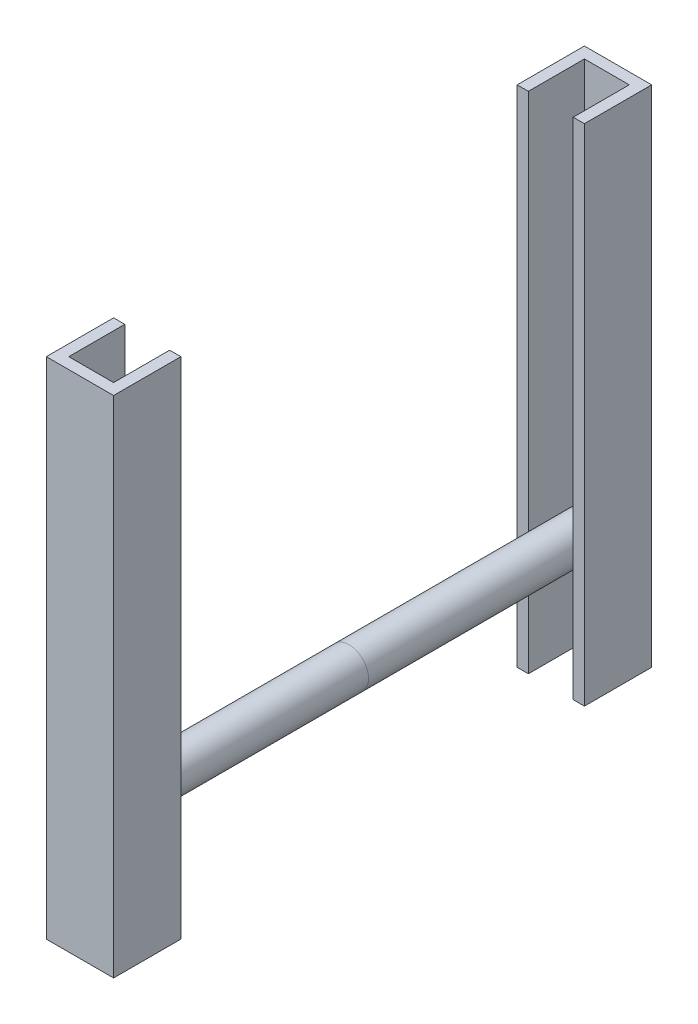
ISO-10303-21;
HEADER;
FILE_DESCRIPTION(('STEP AP214'),'2;1');
FILE_NAME('part.step','',(''),(''),'','','');
FILE_SCHEMA(('AUTOMOTIVE_DESIGN { 1 0 10303 214 1 1 1 1 }'));
ENDSEC;
DATA;
#1=APPLICATION_CONTEXT('core data for automotive mechanical design processes');
#2=APPLICATION_PROTOCOL_DEFINITION('international standard','automotive_design',2000,#1);
#3=PRODUCT_CONTEXT('',#1,'mechanical');
#4=PRODUCT('Part','Part','',(#3));
#5=PRODUCT_RELATED_PRODUCT_CATEGORY('part','',(#4));
#6=PRODUCT_DEFINITION_FORMATION('','',#4);
#7=PRODUCT_DEFINITION_CONTEXT('part definition',#1,'design');
#8=PRODUCT_DEFINITION('design','',#6,#7);
#9=PRODUCT_DEFINITION_SHAPE('','',#8);
#10=(LENGTH_UNIT() NAMED_UNIT(*) SI_UNIT(.MILLI.,.METRE.));
#11=(NAMED_UNIT(*) PLANE_ANGLE_UNIT() SI_UNIT($,.RADIAN.));
#12=(NAMED_UNIT(*) SI_UNIT($,.STERADIAN.) SOLID_ANGLE_UNIT());
#13=UNCERTAINTY_MEASURE_WITH_UNIT(LENGTH_MEASURE(1.E-05),#10,'distance_accuracy_value','');
#14=(GEOMETRIC_REPRESENTATION_CONTEXT(3) GLOBAL_UNCERTAINTY_ASSIGNED_CONTEXT((#13)) GLOBAL_UNIT_ASSIGNED_CONTEXT((#10,
#11,#12)) REPRESENTATION_CONTEXT('',''));
#15=CARTESIAN_POINT('',(0.,0.,0.));
#16=DIRECTION('',(0.,0.,1.));
#17=DIRECTION('',(1.,0.,0.));
#18=AXIS2_PLACEMENT_3D('',#15,#16,#17);
#19=CARTESIAN_POINT('',(20.,225.,-390.));
#20=DIRECTION('',(0.,0.,-1.));
#21=DIRECTION('',(1.,0.,0.));
#22=AXIS2_PLACEMENT_3D('',#19,#20,#21);
#23=PLANE('',#22);
#24=DIRECTION('',(-1.,0.,0.));
#25=VECTOR('',#24,1.);
#26=CARTESIAN_POINT('',(20.,-225.,-390.));
#27=LINE('',#26,#25);
#28=CARTESIAN_POINT('',(30.,-225.,-390.));
#29=VERTEX_POINT('',#28);
#30=CARTESIAN_POINT('',(20.,-225.,-390.));
#31=VERTEX_POINT('',#30);
#32=EDGE_CURVE('E150',#29,#31,#27,.T.);
#33=ORIENTED_EDGE('',*,*,#32,.F.);
#34=DIRECTION('',(0.,-1.,0.));
#35=VECTOR('',#34,1.);
#36=CARTESIAN_POINT('',(30.,225.,-390.));
#37=LINE('',#36,#35);
#38=CARTESIAN_POINT('',(30.,225.,-390.));
#39=VERTEX_POINT('',#38);
#40=EDGE_CURVE('E149',#39,#29,#37,.T.);
#41=ORIENTED_EDGE('',*,*,#40,.F.);
#42=DIRECTION('',(-1.,0.,0.));
#43=VECTOR('',#42,1.);
#44=CARTESIAN_POINT('',(20.,225.,-390.));
#45=LINE('',#44,#43);
#46=CARTESIAN_POINT('',(20.,225.,-390.));
#47=VERTEX_POINT('',#46);
#48=EDGE_CURVE('E176',#39,#47,#45,.T.);
#49=ORIENTED_EDGE('',*,*,#48,.T.);
#50=DIRECTION('',(0.,-1.,0.));
#51=VECTOR('',#50,1.);
#52=CARTESIAN_POINT('',(20.,225.,-390.));
#53=LINE('',#52,#51);
#54=EDGE_CURVE('E12',#47,#31,#53,.T.);
#55=ORIENTED_EDGE('',*,*,#54,.T.);
#56=EDGE_LOOP('',(#33,#41,#49,#55));
#57=FACE_BOUND('',#56,.T.);
#58=ADVANCED_FACE('F48',(#57),#23,.F.);
#59=CARTESIAN_POINT('',(20.,225.,-440.));
#60=DIRECTION('',(1.,0.,0.));
#61=DIRECTION('',(0.,0.,1.));
#62=AXIS2_PLACEMENT_3D('',#59,#60,#61);
#63=PLANE('',#62);
#64=DIRECTION('',(0.,0.,-1.));
#65=VECTOR('',#64,1.);
#66=CARTESIAN_POINT('',(20.,-225.,-440.));
#67=LINE('',#66,#65);
#68=CARTESIAN_POINT('',(20.,-225.,-440.));
#69=VERTEX_POINT('',#68);
#70=EDGE_CURVE('E153',#31,#69,#67,.T.);
#71=ORIENTED_EDGE('',*,*,#70,.F.);
#72=ORIENTED_EDGE('',*,*,#54,.F.);
#73=DIRECTION('',(0.,0.,-1.));
#74=VECTOR('',#73,1.);
#75=CARTESIAN_POINT('',(20.,225.,-400.));
#76=LINE('',#75,#74);
#77=CARTESIAN_POINT('',(20.,225.,-440.));
#78=VERTEX_POINT('',#77);
#79=EDGE_CURVE('E103',#47,#78,#76,.T.);
#80=ORIENTED_EDGE('',*,*,#79,.T.);
#81=DIRECTION('',(0.,-1.,0.));
#82=VECTOR('',#81,1.);
#83=CARTESIAN_POINT('',(20.,225.,-440.));
#84=LINE('',#83,#82);
#85=EDGE_CURVE('E57',#78,#69,#84,.T.);
#86=ORIENTED_EDGE('',*,*,#85,.T.);
#87=EDGE_LOOP('',(#71,#72,#80,#86));
#88=FACE_BOUND('',#87,.T.);
#89=ADVANCED_FACE('F194',(#88),#63,.F.);
#90=CARTESIAN_POINT('',(-20.,225.,-440.));
#91=DIRECTION('',(0.,0.,-1.));
#92=DIRECTION('',(1.,0.,0.));
#93=AXIS2_PLACEMENT_3D('',#90,#91,#92);
#94=PLANE('',#93);
#95=DIRECTION('',(-1.,0.,0.));
#96=VECTOR('',#95,1.);
#97=CARTESIAN_POINT('',(-20.,-225.,-440.));
#98=LINE('',#97,#96);
#99=CARTESIAN_POINT('',(-20.,-225.,-440.));
#100=VERTEX_POINT('',#99);
#101=EDGE_CURVE('E157',#69,#100,#98,.T.);
#102=ORIENTED_EDGE('',*,*,#101,.F.);
#103=ORIENTED_EDGE('',*,*,#85,.F.);
#104=DIRECTION('',(-1.,0.,0.));
#105=VECTOR('',#104,1.);
#106=CARTESIAN_POINT('',(-20.,225.,-440.));
#107=LINE('',#106,#105);
#108=CARTESIAN_POINT('',(-20.,225.,-440.));
#109=VERTEX_POINT('',#108);
#110=EDGE_CURVE('E205',#78,#109,#107,.T.);
#111=ORIENTED_EDGE('',*,*,#110,.T.);
#112=DIRECTION('',(0.,-1.,0.));
#113=VECTOR('',#112,1.);
#114=CARTESIAN_POINT('',(-20.,225.,-440.));
#115=LINE('',#114,#113);
#116=EDGE_CURVE('E187',#109,#100,#115,.T.);
#117=ORIENTED_EDGE('',*,*,#116,.T.);
#118=EDGE_LOOP('',(#102,#103,#111,#117));
#119=FACE_BOUND('',#118,.T.);
#120=ADVANCED_FACE('F217',(#119),#94,.F.);
#121=CARTESIAN_POINT('',(-20.,225.,-400.));
#122=DIRECTION('',(-1.,0.,0.));
#123=DIRECTION('',(0.,0.,-1.));
#124=AXIS2_PLACEMENT_3D('',#121,#122,#123);
#125=PLANE('',#124);
#126=DIRECTION('',(0.,0.,1.));
#127=VECTOR('',#126,1.);
#128=CARTESIAN_POINT('',(-20.,-225.,-400.));
#129=LINE('',#128,#127);
#130=CARTESIAN_POINT('',(-20.,-225.,-390.));
#131=VERTEX_POINT('',#130);
#132=EDGE_CURVE('E161',#100,#131,#129,.T.);
#133=ORIENTED_EDGE('',*,*,#132,.F.);
#134=ORIENTED_EDGE('',*,*,#116,.F.);
#135=DIRECTION('',(0.,0.,1.));
#136=VECTOR('',#135,1.);
#137=CARTESIAN_POINT('',(-20.,225.,-440.));
#138=LINE('',#137,#136);
#139=CARTESIAN_POINT('',(-20.,225.,-390.));
#140=VERTEX_POINT('',#139);
#141=EDGE_CURVE('E143',#109,#140,#138,.T.);
#142=ORIENTED_EDGE('',*,*,#141,.T.);
#143=DIRECTION('',(0.,-1.,0.));
#144=VECTOR('',#143,1.);
#145=CARTESIAN_POINT('',(-20.,225.,-390.));
#146=LINE('',#145,#144);
#147=EDGE_CURVE('E183',#140,#131,#146,.T.);
#148=ORIENTED_EDGE('',*,*,#147,.T.);
#149=EDGE_LOOP('',(#133,#134,#142,#148));
#150=FACE_BOUND('',#149,.T.);
#151=ADVANCED_FACE('F213',(#150),#125,.F.);
#152=CARTESIAN_POINT('',(-30.,225.,-390.));
#153=DIRECTION('',(0.,0.,-1.));
#154=DIRECTION('',(1.,0.,0.));
#155=AXIS2_PLACEMENT_3D('',#152,#153,#154);
#156=PLANE('',#155);
#157=DIRECTION('',(-1.,0.,0.));
#158=VECTOR('',#157,1.);
#159=CARTESIAN_POINT('',(-30.,-225.,-390.));
#160=LINE('',#159,#158);
#161=CARTESIAN_POINT('',(-30.,-225.,-390.));
#162=VERTEX_POINT('',#161);
#163=EDGE_CURVE('E165',#131,#162,#160,.T.);
#164=ORIENTED_EDGE('',*,*,#163,.F.);
#165=ORIENTED_EDGE('',*,*,#147,.F.);
#166=DIRECTION('',(-1.,0.,0.));
#167=VECTOR('',#166,1.);
#168=CARTESIAN_POINT('',(-30.,225.,-390.));
#169=LINE('',#168,#167);
#170=CARTESIAN_POINT('',(-30.,225.,-390.));
#171=VERTEX_POINT('',#170);
#172=EDGE_CURVE('E140',#140,#171,#169,.T.);
#173=ORIENTED_EDGE('',*,*,#172,.T.);
#174=DIRECTION('',(0.,-1.,0.));
#175=VECTOR('',#174,1.);
#176=CARTESIAN_POINT('',(-30.,225.,-390.));
#177=LINE('',#176,#175);
#178=EDGE_CURVE('E133',#171,#162,#177,.T.);
#179=ORIENTED_EDGE('',*,*,#178,.T.);
#180=EDGE_LOOP('',(#164,#165,#173,#179));
#181=FACE_BOUND('',#180,.T.);
#182=ADVANCED_FACE('F216',(#181),#156,.F.);
#183=CARTESIAN_POINT('',(-30.,225.,-450.));
#184=DIRECTION('',(1.,0.,0.));
#185=DIRECTION('',(0.,0.,1.));
#186=AXIS2_PLACEMENT_3D('',#183,#184,#185);
#187=PLANE('',#186);
#188=DIRECTION('',(0.,0.,-1.));
#189=VECTOR('',#188,1.);
#190=CARTESIAN_POINT('',(-30.,-225.,-450.));
#191=LINE('',#190,#189);
#192=CARTESIAN_POINT('',(-30.,-225.,-450.));
#193=VERTEX_POINT('',#192);
#194=EDGE_CURVE('E169',#162,#193,#191,.T.);
#195=ORIENTED_EDGE('',*,*,#194,.F.);
#196=ORIENTED_EDGE('',*,*,#178,.F.);
#197=DIRECTION('',(0.,0.,-1.));
#198=VECTOR('',#197,1.);
#199=CARTESIAN_POINT('',(-30.,225.,-450.));
#200=LINE('',#199,#198);
#201=CARTESIAN_POINT('',(-30.,225.,-450.));
#202=VERTEX_POINT('',#201);
#203=EDGE_CURVE('E121',#171,#202,#200,.T.);
#204=ORIENTED_EDGE('',*,*,#203,.T.);
#205=DIRECTION('',(0.,-1.,0.));
#206=VECTOR('',#205,1.);
#207=CARTESIAN_POINT('',(-30.,225.,-450.));
#208=LINE('',#207,#206);
#209=EDGE_CURVE('E127',#202,#193,#208,.T.);
#210=ORIENTED_EDGE('',*,*,#209,.T.);
#211=EDGE_LOOP('',(#195,#196,#204,#210));
#212=FACE_BOUND('',#211,.T.);
#213=ADVANCED_FACE('F136',(#212),#187,.F.);
#214=CARTESIAN_POINT('',(-30.,225.,-450.));
#215=DIRECTION('',(0.,0.,1.));
#216=DIRECTION('',(-1.,0.,0.));
#217=AXIS2_PLACEMENT_3D('',#214,#215,#216);
#218=PLANE('',#217);
#219=DIRECTION('',(1.,0.,0.));
#220=VECTOR('',#219,1.);
#221=CARTESIAN_POINT('',(-30.,-225.,-450.));
#222=LINE('',#221,#220);
#223=CARTESIAN_POINT('',(30.,-225.,-450.));
#224=VERTEX_POINT('',#223);
#225=EDGE_CURVE('E129',#193,#224,#222,.T.);
#226=ORIENTED_EDGE('',*,*,#225,.F.);
#227=ORIENTED_EDGE('',*,*,#209,.F.);
#228=DIRECTION('',(1.,0.,0.));
#229=VECTOR('',#228,1.);
#230=CARTESIAN_POINT('',(-30.,225.,-450.));
#231=LINE('',#230,#229);
#232=CARTESIAN_POINT('',(30.,225.,-450.));
#233=VERTEX_POINT('',#232);
#234=EDGE_CURVE('E117',#202,#233,#231,.T.);
#235=ORIENTED_EDGE('',*,*,#234,.T.);
#236=DIRECTION('',(0.,-1.,0.));
#237=VECTOR('',#236,1.);
#238=CARTESIAN_POINT('',(30.,225.,-450.));
#239=LINE('',#238,#237);
#240=EDGE_CURVE('E134',#233,#224,#239,.T.);
#241=ORIENTED_EDGE('',*,*,#240,.T.);
#242=EDGE_LOOP('',(#226,#227,#235,#241));
#243=FACE_BOUND('',#242,.T.);
#244=ADVANCED_FACE('F128',(#243),#218,.F.);
#245=CARTESIAN_POINT('',(30.,225.,-450.));
#246=DIRECTION('',(-1.,0.,0.));
#247=DIRECTION('',(0.,0.,-1.));
#248=AXIS2_PLACEMENT_3D('',#245,#246,#247);
#249=PLANE('',#248);
#250=DIRECTION('',(0.,0.,1.));
#251=VECTOR('',#250,1.);
#252=CARTESIAN_POINT('',(30.,-225.,-450.));
#253=LINE('',#252,#251);
#254=EDGE_CURVE('E91',#224,#29,#253,.T.);
#255=ORIENTED_EDGE('',*,*,#254,.F.);
#256=ORIENTED_EDGE('',*,*,#240,.F.);
#257=DIRECTION('',(0.,0.,1.));
#258=VECTOR('',#257,1.);
#259=CARTESIAN_POINT('',(30.,225.,-450.));
#260=LINE('',#259,#258);
#261=EDGE_CURVE('E65',#233,#39,#260,.T.);
#262=ORIENTED_EDGE('',*,*,#261,.T.);
#263=ORIENTED_EDGE('',*,*,#40,.T.);
#264=EDGE_LOOP('',(#255,#256,#262,#263));
#265=FACE_BOUND('',#264,.T.);
#266=ADVANCED_FACE('F269',(#265),#249,.F.);
#267=CARTESIAN_POINT('',(0.,225.,-420.));
#268=DIRECTION('',(0.,1.,0.));
#269=DIRECTION('',(0.,0.,-1.));
#270=AXIS2_PLACEMENT_3D('',#267,#268,#269);
#271=PLANE('',#270);
#272=ORIENTED_EDGE('',*,*,#48,.F.);
#273=ORIENTED_EDGE('',*,*,#261,.F.);
#274=ORIENTED_EDGE('',*,*,#234,.F.);
#275=ORIENTED_EDGE('',*,*,#203,.F.);
#276=ORIENTED_EDGE('',*,*,#172,.F.);
#277=ORIENTED_EDGE('',*,*,#141,.F.);
#278=ORIENTED_EDGE('',*,*,#110,.F.);
#279=ORIENTED_EDGE('',*,*,#79,.F.);
#280=EDGE_LOOP('',(#272,#273,#274,#275,#276,#277,#278,#279));
#281=FACE_BOUND('',#280,.T.);
#282=ADVANCED_FACE('F119',(#281),#271,.T.);
#283=CARTESIAN_POINT('',(0.,-225.,-420.));
#284=DIRECTION('',(0.,1.,0.));
#285=DIRECTION('',(0.,0.,-1.));
#286=AXIS2_PLACEMENT_3D('',#283,#284,#285);
#287=PLANE('',#286);
#288=ORIENTED_EDGE('',*,*,#32,.T.);
#289=ORIENTED_EDGE('',*,*,#70,.T.);
#290=ORIENTED_EDGE('',*,*,#101,.T.);
#291=ORIENTED_EDGE('',*,*,#132,.T.);
#292=ORIENTED_EDGE('',*,*,#163,.T.);
#293=ORIENTED_EDGE('',*,*,#194,.T.);
#294=ORIENTED_EDGE('',*,*,#225,.T.);
#295=ORIENTED_EDGE('',*,*,#254,.T.);
#296=EDGE_LOOP('',(#288,#289,#290,#291,#292,#293,#294,#295));
#297=FACE_BOUND('',#296,.T.);
#298=ADVANCED_FACE('F197',(#297),#287,.F.);
#299=CLOSED_SHELL('',(#58,#89,#120,#151,#182,#213,#244,#266,#282,#298));
#300=MANIFOLD_SOLID_BREP('B2',#299);
#301=CARTESIAN_POINT('',(0.,-120.,-210.));
#302=DIRECTION('',(0.,0.,-1.));
#303=DIRECTION('',(1.,0.,0.));
#304=AXIS2_PLACEMENT_3D('',#301,#302,#303);
#305=CYLINDRICAL_SURFACE('',#304,17.5);
#306=CARTESIAN_POINT('',(0.,-120.,-210.));
#307=DIRECTION('',(0.,0.,1.));
#308=DIRECTION('',(1.,0.,0.));
#309=AXIS2_PLACEMENT_3D('',#306,#307,#308);
#310=CIRCLE('',#309,17.5);
#311=CARTESIAN_POINT('',(17.5,-120.,-210.));
#312=VERTEX_POINT('',#311);
#313=EDGE_CURVE('E47',#312,#312,#310,.T.);
#314=ORIENTED_EDGE('',*,*,#313,.F.);
#315=EDGE_LOOP('',(#314));
#316=FACE_BOUND('',#315,.T.);
#317=CARTESIAN_POINT('',(0.,-120.,-420.));
#318=DIRECTION('',(0.,0.,1.));
#319=DIRECTION('',(1.,0.,0.));
#320=AXIS2_PLACEMENT_3D('',#317,#318,#319);
#321=CIRCLE('',#320,17.5);
#322=CARTESIAN_POINT('',(17.5,-120.,-420.));
#323=VERTEX_POINT('',#322);
#324=EDGE_CURVE('E317',#323,#323,#321,.T.);
#325=ORIENTED_EDGE('',*,*,#324,.T.);
#326=EDGE_LOOP('',(#325));
#327=FACE_BOUND('',#326,.T.);
#328=ADVANCED_FACE('F314',(#316,#327),#305,.T.);
#329=CARTESIAN_POINT('',(0.,-120.,-210.));
#330=DIRECTION('',(0.,0.,-1.));
#331=DIRECTION('',(1.,0.,0.));
#332=AXIS2_PLACEMENT_3D('',#329,#330,#331);
#333=PLANE('',#332);
#334=ORIENTED_EDGE('',*,*,#313,.T.);
#335=EDGE_LOOP('',(#334));
#336=FACE_BOUND('',#335,.T.);
#337=ADVANCED_FACE('F329',(#336),#333,.F.);
#338=CARTESIAN_POINT('',(0.,-120.,-420.));
#339=DIRECTION('',(0.,0.,-1.));
#340=DIRECTION('',(1.,0.,0.));
#341=AXIS2_PLACEMENT_3D('',#338,#339,#340);
#342=PLANE('',#341);
#343=ORIENTED_EDGE('',*,*,#324,.F.);
#344=EDGE_LOOP('',(#343));
#345=FACE_BOUND('',#344,.T.);
#346=ADVANCED_FACE('F327',(#345),#342,.T.);
#347=CLOSED_SHELL('',(#328,#337,#346));
#348=MANIFOLD_SOLID_BREP('B6',#347);
#349=CARTESIAN_POINT('',(0.,-120.,-210.));
#350=DIRECTION('',(0.,0.,1.));
#351=DIRECTION('',(1.,0.,0.));
#352=AXIS2_PLACEMENT_3D('',#349,#350,#351);
#353=CYLINDRICAL_SURFACE('',#352,17.5);
#354=CARTESIAN_POINT('',(0.,-120.,-210.));
#355=DIRECTION('',(0.,0.,1.));
#356=DIRECTION('',(1.,0.,0.));
#357=AXIS2_PLACEMENT_3D('',#354,#355,#356);
#358=CIRCLE('',#357,17.5);
#359=CARTESIAN_POINT('',(17.5,-120.,-210.));
#360=VERTEX_POINT('',#359);
#361=EDGE_CURVE('E313',#360,#360,#358,.T.);
#362=ORIENTED_EDGE('',*,*,#361,.T.);
#363=EDGE_LOOP('',(#362));
#364=FACE_BOUND('',#363,.T.);
#365=CARTESIAN_POINT('',(0.,-120.,0.));
#366=DIRECTION('',(0.,0.,1.));
#367=DIRECTION('',(1.,0.,0.));
#368=AXIS2_PLACEMENT_3D('',#365,#366,#367);
#369=CIRCLE('',#368,17.5);
#370=CARTESIAN_POINT('',(17.5,-120.,0.));
#371=VERTEX_POINT('',#370);
#372=EDGE_CURVE('E367',#371,#371,#369,.T.);
#373=ORIENTED_EDGE('',*,*,#372,.F.);
#374=EDGE_LOOP('',(#373));
#375=FACE_BOUND('',#374,.T.);
#376=ADVANCED_FACE('F364',(#364,#375),#353,.T.);
#377=CARTESIAN_POINT('',(0.,-120.,-210.));
#378=DIRECTION('',(0.,0.,1.));
#379=DIRECTION('',(1.,0.,0.));
#380=AXIS2_PLACEMENT_3D('',#377,#378,#379);
#381=PLANE('',#380);
#382=ORIENTED_EDGE('',*,*,#361,.F.);
#383=EDGE_LOOP('',(#382));
#384=FACE_BOUND('',#383,.T.);
#385=ADVANCED_FACE('F379',(#384),#381,.F.);
#386=CARTESIAN_POINT('',(0.,-120.,0.));
#387=DIRECTION('',(0.,0.,1.));
#388=DIRECTION('',(1.,0.,0.));
#389=AXIS2_PLACEMENT_3D('',#386,#387,#388);
#390=PLANE('',#389);
#391=ORIENTED_EDGE('',*,*,#372,.T.);
#392=EDGE_LOOP('',(#391));
#393=FACE_BOUND('',#392,.T.);
#394=ADVANCED_FACE('F376',(#393),#390,.T.);
#395=CLOSED_SHELL('',(#376,#385,#394));
#396=MANIFOLD_SOLID_BREP('B42',#395);
#397=CARTESIAN_POINT('',(20.,225.,-30.));
#398=DIRECTION('',(0.,0.,1.));
#399=DIRECTION('',(1.,0.,0.));
#400=AXIS2_PLACEMENT_3D('',#397,#398,#399);
#401=PLANE('',#400);
#402=DIRECTION('',(-1.,0.,0.));
#403=VECTOR('',#402,1.);
#404=CARTESIAN_POINT('',(20.,-225.,-30.));
#405=LINE('',#404,#403);
#406=CARTESIAN_POINT('',(30.,-225.,-30.));
#407=VERTEX_POINT('',#406);
#408=CARTESIAN_POINT('',(20.,-225.,-30.));
#409=VERTEX_POINT('',#408);
#410=EDGE_CURVE('E501',#407,#409,#405,.T.);
#411=ORIENTED_EDGE('',*,*,#410,.T.);
#412=DIRECTION('',(0.,-1.,0.));
#413=VECTOR('',#412,1.);
#414=CARTESIAN_POINT('',(20.,225.,-30.));
#415=LINE('',#414,#413);
#416=CARTESIAN_POINT('',(20.,225.,-30.));
#417=VERTEX_POINT('',#416);
#418=EDGE_CURVE('E362',#417,#409,#415,.T.);
#419=ORIENTED_EDGE('',*,*,#418,.F.);
#420=DIRECTION('',(-1.,0.,0.));
#421=VECTOR('',#420,1.);
#422=CARTESIAN_POINT('',(20.,225.,-30.));
#423=LINE('',#422,#421);
#424=CARTESIAN_POINT('',(30.,225.,-30.));
#425=VERTEX_POINT('',#424);
#426=EDGE_CURVE('E516',#425,#417,#423,.T.);
#427=ORIENTED_EDGE('',*,*,#426,.F.);
#428=DIRECTION('',(0.,-1.,0.));
#429=VECTOR('',#428,1.);
#430=CARTESIAN_POINT('',(30.,225.,-30.));
#431=LINE('',#430,#429);
#432=EDGE_CURVE('E497',#425,#407,#431,.T.);
#433=ORIENTED_EDGE('',*,*,#432,.T.);
#434=EDGE_LOOP('',(#411,#419,#427,#433));
#435=FACE_BOUND('',#434,.T.);
#436=ADVANCED_FACE('F405',(#435),#401,.F.);
#437=CARTESIAN_POINT('',(20.,225.,20.));
#438=DIRECTION('',(1.,0.,0.));
#439=DIRECTION('',(0.,0.,-1.));
#440=AXIS2_PLACEMENT_3D('',#437,#438,#439);
#441=PLANE('',#440);
#442=DIRECTION('',(0.,0.,1.));
#443=VECTOR('',#442,1.);
#444=CARTESIAN_POINT('',(20.,-225.,20.));
#445=LINE('',#444,#443);
#446=CARTESIAN_POINT('',(20.,-225.,20.));
#447=VERTEX_POINT('',#446);
#448=EDGE_CURVE('E504',#409,#447,#445,.T.);
#449=ORIENTED_EDGE('',*,*,#448,.T.);
#450=DIRECTION('',(0.,-1.,0.));
#451=VECTOR('',#450,1.);
#452=CARTESIAN_POINT('',(20.,225.,20.));
#453=LINE('',#452,#451);
#454=CARTESIAN_POINT('',(20.,225.,20.));
#455=VERTEX_POINT('',#454);
#456=EDGE_CURVE('E413',#455,#447,#453,.T.);
#457=ORIENTED_EDGE('',*,*,#456,.F.);
#458=DIRECTION('',(0.,0.,1.));
#459=VECTOR('',#458,1.);
#460=CARTESIAN_POINT('',(20.,225.,-20.));
#461=LINE('',#460,#459);
#462=EDGE_CURVE('E464',#417,#455,#461,.T.);
#463=ORIENTED_EDGE('',*,*,#462,.F.);
#464=ORIENTED_EDGE('',*,*,#418,.T.);
#465=EDGE_LOOP('',(#449,#457,#463,#464));
#466=FACE_BOUND('',#465,.T.);
#467=ADVANCED_FACE('F550',(#466),#441,.F.);
#468=CARTESIAN_POINT('',(-20.,225.,20.));
#469=DIRECTION('',(0.,0.,1.));
#470=DIRECTION('',(1.,0.,0.));
#471=AXIS2_PLACEMENT_3D('',#468,#469,#470);
#472=PLANE('',#471);
#473=DIRECTION('',(-1.,0.,0.));
#474=VECTOR('',#473,1.);
#475=CARTESIAN_POINT('',(-20.,-225.,20.));
#476=LINE('',#475,#474);
#477=CARTESIAN_POINT('',(-20.,-225.,20.));
#478=VERTEX_POINT('',#477);
#479=EDGE_CURVE('E506',#447,#478,#476,.T.);
#480=ORIENTED_EDGE('',*,*,#479,.T.);
#481=DIRECTION('',(0.,-1.,0.));
#482=VECTOR('',#481,1.);
#483=CARTESIAN_POINT('',(-20.,225.,20.));
#484=LINE('',#483,#482);
#485=CARTESIAN_POINT('',(-20.,225.,20.));
#486=VERTEX_POINT('',#485);
#487=EDGE_CURVE('E523',#486,#478,#484,.T.);
#488=ORIENTED_EDGE('',*,*,#487,.F.);
#489=DIRECTION('',(-1.,0.,0.));
#490=VECTOR('',#489,1.);
#491=CARTESIAN_POINT('',(-20.,225.,20.));
#492=LINE('',#491,#490);
#493=EDGE_CURVE('E531',#455,#486,#492,.T.);
#494=ORIENTED_EDGE('',*,*,#493,.F.);
#495=ORIENTED_EDGE('',*,*,#456,.T.);
#496=EDGE_LOOP('',(#480,#488,#494,#495));
#497=FACE_BOUND('',#496,.T.);
#498=ADVANCED_FACE('F529',(#497),#472,.F.);
#499=CARTESIAN_POINT('',(-20.,225.,-20.));
#500=DIRECTION('',(-1.,0.,0.));
#501=DIRECTION('',(0.,0.,1.));
#502=AXIS2_PLACEMENT_3D('',#499,#500,#501);
#503=PLANE('',#502);
#504=DIRECTION('',(0.,0.,-1.));
#505=VECTOR('',#504,1.);
#506=CARTESIAN_POINT('',(-20.,-225.,-20.));
#507=LINE('',#506,#505);
#508=CARTESIAN_POINT('',(-20.,-225.,-30.));
#509=VERTEX_POINT('',#508);
#510=EDGE_CURVE('E509',#478,#509,#507,.T.);
#511=ORIENTED_EDGE('',*,*,#510,.T.);
#512=DIRECTION('',(0.,-1.,0.));
#513=VECTOR('',#512,1.);
#514=CARTESIAN_POINT('',(-20.,225.,-30.));
#515=LINE('',#514,#513);
#516=CARTESIAN_POINT('',(-20.,225.,-30.));
#517=VERTEX_POINT('',#516);
#518=EDGE_CURVE('E520',#517,#509,#515,.T.);
#519=ORIENTED_EDGE('',*,*,#518,.F.);
#520=DIRECTION('',(0.,0.,-1.));
#521=VECTOR('',#520,1.);
#522=CARTESIAN_POINT('',(-20.,225.,20.));
#523=LINE('',#522,#521);
#524=EDGE_CURVE('E542',#486,#517,#523,.T.);
#525=ORIENTED_EDGE('',*,*,#524,.F.);
#526=ORIENTED_EDGE('',*,*,#487,.T.);
#527=EDGE_LOOP('',(#511,#519,#525,#526));
#528=FACE_BOUND('',#527,.T.);
#529=ADVANCED_FACE('F538',(#528),#503,.F.);
#530=CARTESIAN_POINT('',(-30.,225.,-30.));
#531=DIRECTION('',(0.,0.,1.));
#532=DIRECTION('',(1.,0.,0.));
#533=AXIS2_PLACEMENT_3D('',#530,#531,#532);
#534=PLANE('',#533);
#535=DIRECTION('',(-1.,0.,0.));
#536=VECTOR('',#535,1.);
#537=CARTESIAN_POINT('',(-30.,-225.,-30.));
#538=LINE('',#537,#536);
#539=CARTESIAN_POINT('',(-30.,-225.,-30.));
#540=VERTEX_POINT('',#539);
#541=EDGE_CURVE('E511',#509,#540,#538,.T.);
#542=ORIENTED_EDGE('',*,*,#541,.T.);
#543=DIRECTION('',(0.,-1.,0.));
#544=VECTOR('',#543,1.);
#545=CARTESIAN_POINT('',(-30.,225.,-30.));
#546=LINE('',#545,#544);
#547=CARTESIAN_POINT('',(-30.,225.,-30.));
#548=VERTEX_POINT('',#547);
#549=EDGE_CURVE('E492',#548,#540,#546,.T.);
#550=ORIENTED_EDGE('',*,*,#549,.F.);
#551=DIRECTION('',(-1.,0.,0.));
#552=VECTOR('',#551,1.);
#553=CARTESIAN_POINT('',(-30.,225.,-30.));
#554=LINE('',#553,#552);
#555=EDGE_CURVE('E483',#517,#548,#554,.T.);
#556=ORIENTED_EDGE('',*,*,#555,.F.);
#557=ORIENTED_EDGE('',*,*,#518,.T.);
#558=EDGE_LOOP('',(#542,#550,#556,#557));
#559=FACE_BOUND('',#558,.T.);
#560=ADVANCED_FACE('F541',(#559),#534,.F.);
#561=CARTESIAN_POINT('',(-30.,225.,30.));
#562=DIRECTION('',(1.,0.,0.));
#563=DIRECTION('',(0.,0.,-1.));
#564=AXIS2_PLACEMENT_3D('',#561,#562,#563);
#565=PLANE('',#564);
#566=DIRECTION('',(0.,0.,1.));
#567=VECTOR('',#566,1.);
#568=CARTESIAN_POINT('',(-30.,-225.,30.));
#569=LINE('',#568,#567);
#570=CARTESIAN_POINT('',(-30.,-225.,30.));
#571=VERTEX_POINT('',#570);
#572=EDGE_CURVE('E491',#540,#571,#569,.T.);
#573=ORIENTED_EDGE('',*,*,#572,.T.);
#574=DIRECTION('',(0.,-1.,0.));
#575=VECTOR('',#574,1.);
#576=CARTESIAN_POINT('',(-30.,225.,30.));
#577=LINE('',#576,#575);
#578=CARTESIAN_POINT('',(-30.,225.,30.));
#579=VERTEX_POINT('',#578);
#580=EDGE_CURVE('E488',#579,#571,#577,.T.);
#581=ORIENTED_EDGE('',*,*,#580,.F.);
#582=DIRECTION('',(0.,0.,1.));
#583=VECTOR('',#582,1.);
#584=CARTESIAN_POINT('',(-30.,225.,30.));
#585=LINE('',#584,#583);
#586=EDGE_CURVE('E477',#548,#579,#585,.T.);
#587=ORIENTED_EDGE('',*,*,#586,.F.);
#588=ORIENTED_EDGE('',*,*,#549,.T.);
#589=EDGE_LOOP('',(#573,#581,#587,#588));
#590=FACE_BOUND('',#589,.T.);
#591=ADVANCED_FACE('F489',(#590),#565,.F.);
#592=CARTESIAN_POINT('',(-30.,225.,30.));
#593=DIRECTION('',(0.,0.,-1.));
#594=DIRECTION('',(-1.,0.,0.));
#595=AXIS2_PLACEMENT_3D('',#592,#593,#594);
#596=PLANE('',#595);
#597=DIRECTION('',(1.,0.,0.));
#598=VECTOR('',#597,1.);
#599=CARTESIAN_POINT('',(-30.,-225.,30.));
#600=LINE('',#599,#598);
#601=CARTESIAN_POINT('',(30.,-225.,30.));
#602=VERTEX_POINT('',#601);
#603=EDGE_CURVE('E450',#571,#602,#600,.T.);
#604=ORIENTED_EDGE('',*,*,#603,.T.);
#605=DIRECTION('',(0.,-1.,0.));
#606=VECTOR('',#605,1.);
#607=CARTESIAN_POINT('',(30.,225.,30.));
#608=LINE('',#607,#606);
#609=CARTESIAN_POINT('',(30.,225.,30.));
#610=VERTEX_POINT('',#609);
#611=EDGE_CURVE('E493',#610,#602,#608,.T.);
#612=ORIENTED_EDGE('',*,*,#611,.F.);
#613=DIRECTION('',(1.,0.,0.));
#614=VECTOR('',#613,1.);
#615=CARTESIAN_POINT('',(-30.,225.,30.));
#616=LINE('',#615,#614);
#617=EDGE_CURVE('E481',#579,#610,#616,.T.);
#618=ORIENTED_EDGE('',*,*,#617,.F.);
#619=ORIENTED_EDGE('',*,*,#580,.T.);
#620=EDGE_LOOP('',(#604,#612,#618,#619));
#621=FACE_BOUND('',#620,.T.);
#622=ADVANCED_FACE('F495',(#621),#596,.F.);
#623=CARTESIAN_POINT('',(30.,225.,30.));
#624=DIRECTION('',(-1.,0.,0.));
#625=DIRECTION('',(0.,0.,1.));
#626=AXIS2_PLACEMENT_3D('',#623,#624,#625);
#627=PLANE('',#626);
#628=DIRECTION('',(0.,0.,-1.));
#629=VECTOR('',#628,1.);
#630=CARTESIAN_POINT('',(30.,-225.,30.));
#631=LINE('',#630,#629);
#632=EDGE_CURVE('E456',#602,#407,#631,.T.);
#633=ORIENTED_EDGE('',*,*,#632,.T.);
#634=ORIENTED_EDGE('',*,*,#432,.F.);
#635=DIRECTION('',(0.,0.,-1.));
#636=VECTOR('',#635,1.);
#637=CARTESIAN_POINT('',(30.,225.,30.));
#638=LINE('',#637,#636);
#639=EDGE_CURVE('E421',#610,#425,#638,.T.);
#640=ORIENTED_EDGE('',*,*,#639,.F.);
#641=ORIENTED_EDGE('',*,*,#611,.T.);
#642=EDGE_LOOP('',(#633,#634,#640,#641));
#643=FACE_BOUND('',#642,.T.);
#644=ADVANCED_FACE('F566',(#643),#627,.F.);
#645=CARTESIAN_POINT('',(0.,225.,0.));
#646=DIRECTION('',(0.,1.,0.));
#647=DIRECTION('',(0.,0.,1.));
#648=AXIS2_PLACEMENT_3D('',#645,#646,#647);
#649=PLANE('',#648);
#650=ORIENTED_EDGE('',*,*,#426,.T.);
#651=ORIENTED_EDGE('',*,*,#462,.T.);
#652=ORIENTED_EDGE('',*,*,#493,.T.);
#653=ORIENTED_EDGE('',*,*,#524,.T.);
#654=ORIENTED_EDGE('',*,*,#555,.T.);
#655=ORIENTED_EDGE('',*,*,#586,.T.);
#656=ORIENTED_EDGE('',*,*,#617,.T.);
#657=ORIENTED_EDGE('',*,*,#639,.T.);
#658=EDGE_LOOP('',(#650,#651,#652,#653,#654,#655,#656,#657));
#659=FACE_BOUND('',#658,.T.);
#660=ADVANCED_FACE('F479',(#659),#649,.T.);
#661=CARTESIAN_POINT('',(0.,-225.,0.));
#662=DIRECTION('',(0.,1.,0.));
#663=DIRECTION('',(0.,0.,1.));
#664=AXIS2_PLACEMENT_3D('',#661,#662,#663);
#665=PLANE('',#664);
#666=ORIENTED_EDGE('',*,*,#410,.F.);
#667=ORIENTED_EDGE('',*,*,#632,.F.);
#668=ORIENTED_EDGE('',*,*,#603,.F.);
#669=ORIENTED_EDGE('',*,*,#572,.F.);
#670=ORIENTED_EDGE('',*,*,#541,.F.);
#671=ORIENTED_EDGE('',*,*,#510,.F.);
#672=ORIENTED_EDGE('',*,*,#479,.F.);
#673=ORIENTED_EDGE('',*,*,#448,.F.);
#674=EDGE_LOOP('',(#666,#667,#668,#669,#670,#671,#672,#673));
#675=FACE_BOUND('',#674,.T.);
#676=ADVANCED_FACE('F534',(#675),#665,.F.);
#677=CLOSED_SHELL('',(#436,#467,#498,#529,#560,#591,#622,#644,#660,#676));
#678=MANIFOLD_SOLID_BREP('B308',#677);
#679=ADVANCED_BREP_SHAPE_REPRESENTATION('',(#18,#300,#348,#396,#678),#14);
#680=SHAPE_DEFINITION_REPRESENTATION(#9,#679);
ENDSEC;
END-ISO-10303-21;
